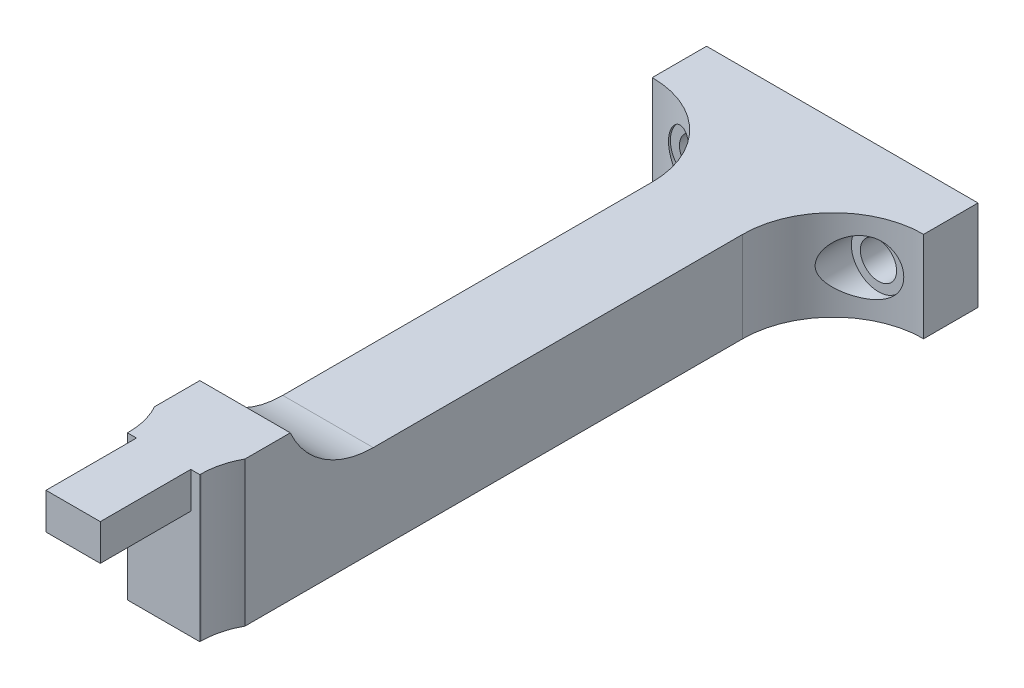
ISO-10303-21;
HEADER;
FILE_DESCRIPTION(('STEP AP214'),'2;1');
FILE_NAME('part.step','',(''),(''),'','','');
FILE_SCHEMA(('AUTOMOTIVE_DESIGN { 1 0 10303 214 1 1 1 1 }'));
ENDSEC;
DATA;
#1=APPLICATION_CONTEXT('core data for automotive mechanical design processes');
#2=APPLICATION_PROTOCOL_DEFINITION('international standard','automotive_design',2000,#1);
#3=PRODUCT_CONTEXT('',#1,'mechanical');
#4=PRODUCT('Part','Part','',(#3));
#5=PRODUCT_RELATED_PRODUCT_CATEGORY('part','',(#4));
#6=PRODUCT_DEFINITION_FORMATION('','',#4);
#7=PRODUCT_DEFINITION_CONTEXT('part definition',#1,'design');
#8=PRODUCT_DEFINITION('design','',#6,#7);
#9=PRODUCT_DEFINITION_SHAPE('','',#8);
#10=(LENGTH_UNIT() NAMED_UNIT(*) SI_UNIT(.MILLI.,.METRE.));
#11=(NAMED_UNIT(*) PLANE_ANGLE_UNIT() SI_UNIT($,.RADIAN.));
#12=(NAMED_UNIT(*) SI_UNIT($,.STERADIAN.) SOLID_ANGLE_UNIT());
#13=UNCERTAINTY_MEASURE_WITH_UNIT(LENGTH_MEASURE(1.E-05),#10,'distance_accuracy_value','');
#14=(GEOMETRIC_REPRESENTATION_CONTEXT(3) GLOBAL_UNCERTAINTY_ASSIGNED_CONTEXT((#13)) GLOBAL_UNIT_ASSIGNED_CONTEXT((#10,
#11,#12)) REPRESENTATION_CONTEXT('',''));
#15=CARTESIAN_POINT('',(0.,0.,0.));
#16=DIRECTION('',(0.,0.,1.));
#17=DIRECTION('',(1.,0.,0.));
#18=AXIS2_PLACEMENT_3D('',#15,#16,#17);
#19=CARTESIAN_POINT('',(0.,0.,69.));
#20=DIRECTION('',(0.,0.,-1.));
#21=DIRECTION('',(-1.,0.,0.));
#22=AXIS2_PLACEMENT_3D('',#19,#20,#21);
#23=PLANE('',#22);
#24=DIRECTION('',(0.,-1.,0.));
#25=VECTOR('',#24,1.);
#26=CARTESIAN_POINT('',(-3.,7.,69.));
#27=LINE('',#26,#25);
#28=CARTESIAN_POINT('',(-3.,11.,69.));
#29=VERTEX_POINT('',#28);
#30=CARTESIAN_POINT('',(-3.,7.,69.));
#31=VERTEX_POINT('',#30);
#32=EDGE_CURVE('E216',#29,#31,#27,.T.);
#33=ORIENTED_EDGE('',*,*,#32,.F.);
#34=DIRECTION('',(-1.,0.,0.));
#35=VECTOR('',#34,1.);
#36=CARTESIAN_POINT('',(-4.,11.,69.));
#37=LINE('',#36,#35);
#38=CARTESIAN_POINT('',(-4.,11.,69.));
#39=VERTEX_POINT('',#38);
#40=EDGE_CURVE('E229',#29,#39,#37,.T.);
#41=ORIENTED_EDGE('',*,*,#40,.T.);
#42=DIRECTION('',(0.,-1.,0.));
#43=VECTOR('',#42,1.);
#44=CARTESIAN_POINT('',(-4.,-5.,69.));
#45=LINE('',#44,#43);
#46=CARTESIAN_POINT('',(-4.,-5.,69.));
#47=VERTEX_POINT('',#46);
#48=EDGE_CURVE('E217',#39,#47,#45,.T.);
#49=ORIENTED_EDGE('',*,*,#48,.T.);
#50=DIRECTION('',(1.,0.,0.));
#51=VECTOR('',#50,1.);
#52=CARTESIAN_POINT('',(-4.,-5.,69.));
#53=LINE('',#52,#51);
#54=CARTESIAN_POINT('',(4.,-5.,69.));
#55=VERTEX_POINT('',#54);
#56=EDGE_CURVE('E220',#47,#55,#53,.T.);
#57=ORIENTED_EDGE('',*,*,#56,.T.);
#58=DIRECTION('',(0.,1.,0.));
#59=VECTOR('',#58,1.);
#60=CARTESIAN_POINT('',(4.,-5.,69.));
#61=LINE('',#60,#59);
#62=CARTESIAN_POINT('',(4.,11.,69.));
#63=VERTEX_POINT('',#62);
#64=EDGE_CURVE('E227',#55,#63,#61,.T.);
#65=ORIENTED_EDGE('',*,*,#64,.T.);
#66=CARTESIAN_POINT('',(3.,11.,69.));
#67=VERTEX_POINT('',#66);
#68=EDGE_CURVE('E230',#63,#67,#37,.T.);
#69=ORIENTED_EDGE('',*,*,#68,.T.);
#70=DIRECTION('',(0.,1.,0.));
#71=VECTOR('',#70,1.);
#72=CARTESIAN_POINT('',(3.,7.,69.));
#73=LINE('',#72,#71);
#74=CARTESIAN_POINT('',(3.,7.,69.));
#75=VERTEX_POINT('',#74);
#76=EDGE_CURVE('E213',#75,#67,#73,.T.);
#77=ORIENTED_EDGE('',*,*,#76,.F.);
#78=DIRECTION('',(1.,0.,0.));
#79=VECTOR('',#78,1.);
#80=CARTESIAN_POINT('',(-3.,7.,69.));
#81=LINE('',#80,#79);
#82=EDGE_CURVE('E476',#31,#75,#81,.T.);
#83=ORIENTED_EDGE('',*,*,#82,.F.);
#84=EDGE_LOOP('',(#33,#41,#49,#57,#65,#69,#77,#83));
#85=FACE_BOUND('',#84,.T.);
#86=ADVANCED_FACE('F67',(#85),#23,.F.);
#87=CARTESIAN_POINT('',(-5.,5.,65.));
#88=DIRECTION('',(0.,-1.,0.));
#89=DIRECTION('',(0.,0.,-1.));
#90=AXIS2_PLACEMENT_3D('',#87,#88,#89);
#91=PLANE('',#90);
#92=DIRECTION('',(0.,0.,-1.));
#93=VECTOR('',#92,1.);
#94=CARTESIAN_POINT('',(-5.,5.,65.));
#95=LINE('',#94,#93);
#96=CARTESIAN_POINT('',(-5.,5.,50.8348486100883));
#97=VERTEX_POINT('',#96);
#98=CARTESIAN_POINT('',(-5.,5.,10.));
#99=VERTEX_POINT('',#98);
#100=EDGE_CURVE('E295',#97,#99,#95,.T.);
#101=ORIENTED_EDGE('',*,*,#100,.F.);
#102=DIRECTION('',(1.,0.,0.));
#103=VECTOR('',#102,1.);
#104=CARTESIAN_POINT('',(-5.,5.,50.8348486100883));
#105=LINE('',#104,#103);
#106=CARTESIAN_POINT('',(5.,5.,50.8348486100883));
#107=VERTEX_POINT('',#106);
#108=EDGE_CURVE('E301',#97,#107,#105,.T.);
#109=ORIENTED_EDGE('',*,*,#108,.T.);
#110=DIRECTION('',(0.,0.,-1.));
#111=VECTOR('',#110,1.);
#112=CARTESIAN_POINT('',(5.,5.,65.));
#113=LINE('',#112,#111);
#114=CARTESIAN_POINT('',(5.,5.,10.));
#115=VERTEX_POINT('',#114);
#116=EDGE_CURVE('E298',#107,#115,#113,.T.);
#117=ORIENTED_EDGE('',*,*,#116,.T.);
#118=CARTESIAN_POINT('',(15.,5.,10.));
#119=DIRECTION('',(0.,-1.,0.));
#120=DIRECTION('',(0.,0.,-1.));
#121=AXIS2_PLACEMENT_3D('',#118,#119,#120);
#122=CIRCLE('',#121,10.);
#123=CARTESIAN_POINT('',(15.,5.,0.));
#124=VERTEX_POINT('',#123);
#125=EDGE_CURVE('E317',#115,#124,#122,.T.);
#126=ORIENTED_EDGE('',*,*,#125,.T.);
#127=DIRECTION('',(0.,0.,1.));
#128=VECTOR('',#127,1.);
#129=CARTESIAN_POINT('',(15.,5.,-6.));
#130=LINE('',#129,#128);
#131=CARTESIAN_POINT('',(15.,5.,-6.));
#132=VERTEX_POINT('',#131);
#133=EDGE_CURVE('E276',#132,#124,#130,.T.);
#134=ORIENTED_EDGE('',*,*,#133,.F.);
#135=DIRECTION('',(-1.,0.,0.));
#136=VECTOR('',#135,1.);
#137=CARTESIAN_POINT('',(15.,5.,-6.));
#138=LINE('',#137,#136);
#139=CARTESIAN_POINT('',(-15.,5.,-6.));
#140=VERTEX_POINT('',#139);
#141=EDGE_CURVE('E264',#132,#140,#138,.T.);
#142=ORIENTED_EDGE('',*,*,#141,.T.);
#143=DIRECTION('',(0.,0.,1.));
#144=VECTOR('',#143,1.);
#145=CARTESIAN_POINT('',(-15.,5.,-6.));
#146=LINE('',#145,#144);
#147=CARTESIAN_POINT('',(-15.,5.,0.));
#148=VERTEX_POINT('',#147);
#149=EDGE_CURVE('E279',#140,#148,#146,.T.);
#150=ORIENTED_EDGE('',*,*,#149,.T.);
#151=CARTESIAN_POINT('',(-15.,5.,10.));
#152=DIRECTION('',(0.,-1.,0.));
#153=DIRECTION('',(0.,0.,-1.));
#154=AXIS2_PLACEMENT_3D('',#151,#152,#153);
#155=CIRCLE('',#154,10.);
#156=EDGE_CURVE('E315',#148,#99,#155,.T.);
#157=ORIENTED_EDGE('',*,*,#156,.T.);
#158=EDGE_LOOP('',(#101,#109,#117,#126,#134,#142,#150,#157));
#159=FACE_BOUND('',#158,.T.);
#160=ADVANCED_FACE('F366',(#159),#91,.F.);
#161=CARTESIAN_POINT('',(5.,5.,65.));
#162=DIRECTION('',(-1.,0.,0.));
#163=DIRECTION('',(0.,-1.,0.));
#164=AXIS2_PLACEMENT_3D('',#161,#162,#163);
#165=PLANE('',#164);
#166=DIRECTION('',(0.,0.,-1.));
#167=VECTOR('',#166,1.);
#168=CARTESIAN_POINT('',(5.,-5.,65.));
#169=LINE('',#168,#167);
#170=CARTESIAN_POINT('',(5.,-5.,65.));
#171=VERTEX_POINT('',#170);
#172=CARTESIAN_POINT('',(5.,-5.,10.));
#173=VERTEX_POINT('',#172);
#174=EDGE_CURVE('E289',#171,#173,#169,.T.);
#175=ORIENTED_EDGE('',*,*,#174,.T.);
#176=DIRECTION('',(0.,1.,0.));
#177=VECTOR('',#176,1.);
#178=CARTESIAN_POINT('',(5.,5.,10.));
#179=LINE('',#178,#177);
#180=EDGE_CURVE('E306',#173,#115,#179,.T.);
#181=ORIENTED_EDGE('',*,*,#180,.T.);
#182=ORIENTED_EDGE('',*,*,#116,.F.);
#183=CARTESIAN_POINT('',(5.,15.,50.8348486100883));
#184=DIRECTION('',(-1.,0.,0.));
#185=DIRECTION('',(0.,-1.,0.));
#186=AXIS2_PLACEMENT_3D('',#183,#184,#185);
#187=CIRCLE('',#186,10.);
#188=CARTESIAN_POINT('',(5.,11.,60.));
#189=VERTEX_POINT('',#188);
#190=EDGE_CURVE('E311',#107,#189,#187,.T.);
#191=ORIENTED_EDGE('',*,*,#190,.T.);
#192=DIRECTION('',(0.,0.,-1.));
#193=VECTOR('',#192,1.);
#194=CARTESIAN_POINT('',(5.,11.,65.));
#195=LINE('',#194,#193);
#196=CARTESIAN_POINT('',(5.,11.,65.));
#197=VERTEX_POINT('',#196);
#198=EDGE_CURVE('E245',#197,#189,#195,.T.);
#199=ORIENTED_EDGE('',*,*,#198,.F.);
#200=DIRECTION('',(0.,1.,0.));
#201=VECTOR('',#200,1.);
#202=CARTESIAN_POINT('',(5.,5.,65.));
#203=LINE('',#202,#201);
#204=EDGE_CURVE('E284',#171,#197,#203,.T.);
#205=ORIENTED_EDGE('',*,*,#204,.F.);
#206=EDGE_LOOP('',(#175,#181,#182,#191,#199,#205));
#207=FACE_BOUND('',#206,.T.);
#208=ADVANCED_FACE('F405',(#207),#165,.F.);
#209=CARTESIAN_POINT('',(-5.,5.,65.));
#210=DIRECTION('',(1.,0.,0.));
#211=DIRECTION('',(0.,1.,0.));
#212=AXIS2_PLACEMENT_3D('',#209,#210,#211);
#213=PLANE('',#212);
#214=ORIENTED_EDGE('',*,*,#100,.T.);
#215=DIRECTION('',(0.,-1.,0.));
#216=VECTOR('',#215,1.);
#217=CARTESIAN_POINT('',(-5.,-5.,10.));
#218=LINE('',#217,#216);
#219=CARTESIAN_POINT('',(-5.,-5.,10.));
#220=VERTEX_POINT('',#219);
#221=EDGE_CURVE('E303',#99,#220,#218,.T.);
#222=ORIENTED_EDGE('',*,*,#221,.T.);
#223=DIRECTION('',(0.,0.,-1.));
#224=VECTOR('',#223,1.);
#225=CARTESIAN_POINT('',(-5.,-5.,65.));
#226=LINE('',#225,#224);
#227=CARTESIAN_POINT('',(-5.,-5.,65.));
#228=VERTEX_POINT('',#227);
#229=EDGE_CURVE('E292',#228,#220,#226,.T.);
#230=ORIENTED_EDGE('',*,*,#229,.F.);
#231=DIRECTION('',(0.,-1.,0.));
#232=VECTOR('',#231,1.);
#233=CARTESIAN_POINT('',(-5.,5.,65.));
#234=LINE('',#233,#232);
#235=CARTESIAN_POINT('',(-5.,11.,65.));
#236=VERTEX_POINT('',#235);
#237=EDGE_CURVE('E287',#236,#228,#234,.T.);
#238=ORIENTED_EDGE('',*,*,#237,.F.);
#239=DIRECTION('',(0.,0.,1.));
#240=VECTOR('',#239,1.);
#241=CARTESIAN_POINT('',(-5.,11.,65.));
#242=LINE('',#241,#240);
#243=CARTESIAN_POINT('',(-5.,11.,60.));
#244=VERTEX_POINT('',#243);
#245=EDGE_CURVE('E243',#244,#236,#242,.T.);
#246=ORIENTED_EDGE('',*,*,#245,.F.);
#247=CARTESIAN_POINT('',(-5.,15.,50.8348486100883));
#248=DIRECTION('',(1.,0.,0.));
#249=DIRECTION('',(0.,1.,0.));
#250=AXIS2_PLACEMENT_3D('',#247,#248,#249);
#251=CIRCLE('',#250,10.);
#252=EDGE_CURVE('E309',#244,#97,#251,.T.);
#253=ORIENTED_EDGE('',*,*,#252,.T.);
#254=EDGE_LOOP('',(#214,#222,#230,#238,#246,#253));
#255=FACE_BOUND('',#254,.T.);
#256=ADVANCED_FACE('F401',(#255),#213,.F.);
#257=CARTESIAN_POINT('',(-5.,-5.,65.));
#258=DIRECTION('',(0.,1.,0.));
#259=DIRECTION('',(0.,0.,1.));
#260=AXIS2_PLACEMENT_3D('',#257,#258,#259);
#261=PLANE('',#260);
#262=ORIENTED_EDGE('',*,*,#229,.T.);
#263=CARTESIAN_POINT('',(-15.,-5.,10.));
#264=DIRECTION('',(0.,1.,0.));
#265=DIRECTION('',(0.,0.,1.));
#266=AXIS2_PLACEMENT_3D('',#263,#264,#265);
#267=CIRCLE('',#266,10.);
#268=CARTESIAN_POINT('',(-15.,-5.,0.));
#269=VERTEX_POINT('',#268);
#270=EDGE_CURVE('E313',#220,#269,#267,.T.);
#271=ORIENTED_EDGE('',*,*,#270,.T.);
#272=DIRECTION('',(0.,0.,1.));
#273=VECTOR('',#272,1.);
#274=CARTESIAN_POINT('',(-15.,-5.,-6.));
#275=LINE('',#274,#273);
#276=CARTESIAN_POINT('',(-15.,-5.,-6.));
#277=VERTEX_POINT('',#276);
#278=EDGE_CURVE('E281',#277,#269,#275,.T.);
#279=ORIENTED_EDGE('',*,*,#278,.F.);
#280=DIRECTION('',(-1.,0.,0.));
#281=VECTOR('',#280,1.);
#282=CARTESIAN_POINT('',(15.,-5.,-6.));
#283=LINE('',#282,#281);
#284=CARTESIAN_POINT('',(15.,-5.,-6.));
#285=VERTEX_POINT('',#284);
#286=EDGE_CURVE('E258',#285,#277,#283,.T.);
#287=ORIENTED_EDGE('',*,*,#286,.F.);
#288=DIRECTION('',(0.,0.,1.));
#289=VECTOR('',#288,1.);
#290=CARTESIAN_POINT('',(15.,-5.,-6.));
#291=LINE('',#290,#289);
#292=CARTESIAN_POINT('',(15.,-5.,0.));
#293=VERTEX_POINT('',#292);
#294=EDGE_CURVE('E270',#285,#293,#291,.T.);
#295=ORIENTED_EDGE('',*,*,#294,.T.);
#296=CARTESIAN_POINT('',(15.,-5.,10.));
#297=DIRECTION('',(0.,1.,0.));
#298=DIRECTION('',(0.,0.,1.));
#299=AXIS2_PLACEMENT_3D('',#296,#297,#298);
#300=CIRCLE('',#299,10.);
#301=EDGE_CURVE('E319',#293,#173,#300,.T.);
#302=ORIENTED_EDGE('',*,*,#301,.T.);
#303=ORIENTED_EDGE('',*,*,#174,.F.);
#304=CARTESIAN_POINT('',(12.,-5.,68.8729833462074));
#305=DIRECTION('',(0.,1.,0.));
#306=DIRECTION('',(0.,0.,1.));
#307=AXIS2_PLACEMENT_3D('',#304,#305,#306);
#308=CIRCLE('',#307,8.);
#309=CARTESIAN_POINT('',(4.,-5.,68.8729833462074));
#310=VERTEX_POINT('',#309);
#311=EDGE_CURVE('E445',#171,#310,#308,.T.);
#312=ORIENTED_EDGE('',*,*,#311,.T.);
#313=DIRECTION('',(0.,0.,-1.));
#314=VECTOR('',#313,1.);
#315=CARTESIAN_POINT('',(4.,-5.,69.));
#316=LINE('',#315,#314);
#317=EDGE_CURVE('E237',#55,#310,#316,.T.);
#318=ORIENTED_EDGE('',*,*,#317,.F.);
#319=ORIENTED_EDGE('',*,*,#56,.F.);
#320=DIRECTION('',(0.,0.,-1.));
#321=VECTOR('',#320,1.);
#322=CARTESIAN_POINT('',(-4.,-5.,69.));
#323=LINE('',#322,#321);
#324=CARTESIAN_POINT('',(-4.,-5.,68.8729833462074));
#325=VERTEX_POINT('',#324);
#326=EDGE_CURVE('E240',#47,#325,#323,.T.);
#327=ORIENTED_EDGE('',*,*,#326,.T.);
#328=CARTESIAN_POINT('',(-12.,-5.,68.8729833462074));
#329=DIRECTION('',(0.,1.,0.));
#330=DIRECTION('',(0.,0.,1.));
#331=AXIS2_PLACEMENT_3D('',#328,#329,#330);
#332=CIRCLE('',#331,8.);
#333=EDGE_CURVE('E75',#325,#228,#332,.T.);
#334=ORIENTED_EDGE('',*,*,#333,.T.);
#335=EDGE_LOOP('',(#262,#271,#279,#287,#295,#302,#303,#312,#318,#319,#327,#334));
#336=FACE_BOUND('',#335,.T.);
#337=ADVANCED_FACE('F391',(#336),#261,.F.);
#338=CARTESIAN_POINT('',(0.,0.,-6.));
#339=DIRECTION('',(0.,0.,-1.));
#340=DIRECTION('',(-1.,0.,0.));
#341=AXIS2_PLACEMENT_3D('',#338,#339,#340);
#342=PLANE('',#341);
#343=CARTESIAN_POINT('',(10.,0.,-6.));
#344=DIRECTION('',(0.,0.,-1.));
#345=DIRECTION('',(-1.,0.,0.));
#346=AXIS2_PLACEMENT_3D('',#343,#344,#345);
#347=CIRCLE('',#346,2.);
#348=CARTESIAN_POINT('',(8.00000000000001,0.,-6.));
#349=VERTEX_POINT('',#348);
#350=EDGE_CURVE('E254',#349,#349,#347,.T.);
#351=ORIENTED_EDGE('',*,*,#350,.F.);
#352=EDGE_LOOP('',(#351));
#353=FACE_BOUND('',#352,.T.);
#354=ORIENTED_EDGE('',*,*,#286,.T.);
#355=DIRECTION('',(0.,1.,0.));
#356=VECTOR('',#355,1.);
#357=CARTESIAN_POINT('',(-15.,-5.,-6.));
#358=LINE('',#357,#356);
#359=EDGE_CURVE('E261',#277,#140,#358,.T.);
#360=ORIENTED_EDGE('',*,*,#359,.T.);
#361=ORIENTED_EDGE('',*,*,#141,.F.);
#362=DIRECTION('',(0.,1.,0.));
#363=VECTOR('',#362,1.);
#364=CARTESIAN_POINT('',(15.,-5.,-6.));
#365=LINE('',#364,#363);
#366=EDGE_CURVE('E267',#285,#132,#365,.T.);
#367=ORIENTED_EDGE('',*,*,#366,.F.);
#368=EDGE_LOOP('',(#354,#360,#361,#367));
#369=FACE_BOUND('',#368,.T.);
#370=CARTESIAN_POINT('',(-10.,0.,-6.));
#371=DIRECTION('',(0.,0.,-1.));
#372=DIRECTION('',(-1.,0.,0.));
#373=AXIS2_PLACEMENT_3D('',#370,#371,#372);
#374=CIRCLE('',#373,2.);
#375=CARTESIAN_POINT('',(-12.,0.,-6.));
#376=VERTEX_POINT('',#375);
#377=EDGE_CURVE('E251',#376,#376,#374,.T.);
#378=ORIENTED_EDGE('',*,*,#377,.F.);
#379=EDGE_LOOP('',(#378));
#380=FACE_BOUND('',#379,.T.);
#381=ADVANCED_FACE('F387',(#353,#369,#380),#342,.T.);
#382=CARTESIAN_POINT('',(-15.,-5.,-6.));
#383=DIRECTION('',(1.,0.,0.));
#384=DIRECTION('',(0.,0.,-1.));
#385=AXIS2_PLACEMENT_3D('',#382,#383,#384);
#386=PLANE('',#385);
#387=DIRECTION('',(0.,1.,0.));
#388=VECTOR('',#387,1.);
#389=CARTESIAN_POINT('',(-15.,-5.,0.));
#390=LINE('',#389,#388);
#391=EDGE_CURVE('E257',#269,#148,#390,.T.);
#392=ORIENTED_EDGE('',*,*,#391,.T.);
#393=ORIENTED_EDGE('',*,*,#149,.F.);
#394=ORIENTED_EDGE('',*,*,#359,.F.);
#395=ORIENTED_EDGE('',*,*,#278,.T.);
#396=EDGE_LOOP('',(#392,#393,#394,#395));
#397=FACE_BOUND('',#396,.T.);
#398=ADVANCED_FACE('F390',(#397),#386,.F.);
#399=CARTESIAN_POINT('',(15.,-5.,-6.));
#400=DIRECTION('',(1.,0.,0.));
#401=DIRECTION('',(0.,0.,-1.));
#402=AXIS2_PLACEMENT_3D('',#399,#400,#401);
#403=PLANE('',#402);
#404=DIRECTION('',(0.,1.,0.));
#405=VECTOR('',#404,1.);
#406=CARTESIAN_POINT('',(15.,-5.,0.));
#407=LINE('',#406,#405);
#408=EDGE_CURVE('E262',#293,#124,#407,.T.);
#409=ORIENTED_EDGE('',*,*,#408,.F.);
#410=ORIENTED_EDGE('',*,*,#294,.F.);
#411=ORIENTED_EDGE('',*,*,#366,.T.);
#412=ORIENTED_EDGE('',*,*,#133,.T.);
#413=EDGE_LOOP('',(#409,#410,#411,#412));
#414=FACE_BOUND('',#413,.T.);
#415=ADVANCED_FACE('F385',(#414),#403,.T.);
#416=CARTESIAN_POINT('',(10.,0.,-6.));
#417=DIRECTION('',(0.,0.,1.));
#418=DIRECTION('',(1.,0.,0.));
#419=AXIS2_PLACEMENT_3D('',#416,#417,#418);
#420=CYLINDRICAL_SURFACE('',#419,2.);
#421=CARTESIAN_POINT('',(10.,0.,0.));
#422=DIRECTION('',(0.,0.,-1.));
#423=DIRECTION('',(-1.,0.,0.));
#424=AXIS2_PLACEMENT_3D('',#421,#422,#423);
#425=CIRCLE('',#424,2.);
#426=CARTESIAN_POINT('',(8.00000000000001,0.,0.));
#427=VERTEX_POINT('',#426);
#428=EDGE_CURVE('E453',#427,#427,#425,.T.);
#429=ORIENTED_EDGE('',*,*,#428,.F.);
#430=EDGE_LOOP('',(#429));
#431=FACE_BOUND('',#430,.T.);
#432=ORIENTED_EDGE('',*,*,#350,.T.);
#433=EDGE_LOOP('',(#432));
#434=FACE_BOUND('',#433,.T.);
#435=ADVANCED_FACE('F381',(#431,#434),#420,.F.);
#436=CARTESIAN_POINT('',(-10.,0.,-6.));
#437=DIRECTION('',(0.,0.,1.));
#438=DIRECTION('',(1.,0.,0.));
#439=AXIS2_PLACEMENT_3D('',#436,#437,#438);
#440=CYLINDRICAL_SURFACE('',#439,2.);
#441=CARTESIAN_POINT('',(-10.,0.,0.));
#442=DIRECTION('',(0.,0.,-1.));
#443=DIRECTION('',(-1.,0.,0.));
#444=AXIS2_PLACEMENT_3D('',#441,#442,#443);
#445=CIRCLE('',#444,2.);
#446=CARTESIAN_POINT('',(-12.,0.,0.));
#447=VERTEX_POINT('',#446);
#448=EDGE_CURVE('E455',#447,#447,#445,.T.);
#449=ORIENTED_EDGE('',*,*,#448,.F.);
#450=EDGE_LOOP('',(#449));
#451=FACE_BOUND('',#450,.T.);
#452=ORIENTED_EDGE('',*,*,#377,.T.);
#453=EDGE_LOOP('',(#452));
#454=FACE_BOUND('',#453,.T.);
#455=ADVANCED_FACE('F378',(#451,#454),#440,.F.);
#456=CARTESIAN_POINT('',(0.,11.,0.));
#457=DIRECTION('',(0.,-1.,0.));
#458=DIRECTION('',(0.,0.,-1.));
#459=AXIS2_PLACEMENT_3D('',#456,#457,#458);
#460=PLANE('',#459);
#461=ORIENTED_EDGE('',*,*,#245,.T.);
#462=CARTESIAN_POINT('',(-12.,11.,68.8729833462074));
#463=DIRECTION('',(0.,-1.,0.));
#464=DIRECTION('',(0.,0.,-1.));
#465=AXIS2_PLACEMENT_3D('',#462,#463,#464);
#466=CIRCLE('',#465,8.);
#467=CARTESIAN_POINT('',(-4.,11.,68.8729833462074));
#468=VERTEX_POINT('',#467);
#469=EDGE_CURVE('E13',#236,#468,#466,.T.);
#470=ORIENTED_EDGE('',*,*,#469,.T.);
#471=DIRECTION('',(0.,0.,-1.));
#472=VECTOR('',#471,1.);
#473=CARTESIAN_POINT('',(-4.,11.,69.));
#474=LINE('',#473,#472);
#475=EDGE_CURVE('E232',#39,#468,#474,.T.);
#476=ORIENTED_EDGE('',*,*,#475,.F.);
#477=ORIENTED_EDGE('',*,*,#40,.F.);
#478=DIRECTION('',(0.,0.,-1.));
#479=VECTOR('',#478,1.);
#480=CARTESIAN_POINT('',(-3.,11.,79.));
#481=LINE('',#480,#479);
#482=CARTESIAN_POINT('',(-3.,11.,79.));
#483=VERTEX_POINT('',#482);
#484=EDGE_CURVE('E474',#483,#29,#481,.T.);
#485=ORIENTED_EDGE('',*,*,#484,.F.);
#486=DIRECTION('',(-1.,0.,0.));
#487=VECTOR('',#486,1.);
#488=CARTESIAN_POINT('',(-3.,11.,79.));
#489=LINE('',#488,#487);
#490=CARTESIAN_POINT('',(3.,11.,79.));
#491=VERTEX_POINT('',#490);
#492=EDGE_CURVE('E209',#491,#483,#489,.T.);
#493=ORIENTED_EDGE('',*,*,#492,.F.);
#494=DIRECTION('',(0.,0.,-1.));
#495=VECTOR('',#494,1.);
#496=CARTESIAN_POINT('',(3.,11.,79.));
#497=LINE('',#496,#495);
#498=EDGE_CURVE('E222',#491,#67,#497,.T.);
#499=ORIENTED_EDGE('',*,*,#498,.T.);
#500=ORIENTED_EDGE('',*,*,#68,.F.);
#501=DIRECTION('',(0.,0.,-1.));
#502=VECTOR('',#501,1.);
#503=CARTESIAN_POINT('',(4.,11.,69.));
#504=LINE('',#503,#502);
#505=CARTESIAN_POINT('',(4.,11.,68.8729833462074));
#506=VERTEX_POINT('',#505);
#507=EDGE_CURVE('E234',#63,#506,#504,.T.);
#508=ORIENTED_EDGE('',*,*,#507,.T.);
#509=CARTESIAN_POINT('',(12.,11.,68.8729833462074));
#510=DIRECTION('',(0.,-1.,0.));
#511=DIRECTION('',(0.,0.,-1.));
#512=AXIS2_PLACEMENT_3D('',#509,#510,#511);
#513=CIRCLE('',#512,8.);
#514=EDGE_CURVE('E437',#506,#197,#513,.T.);
#515=ORIENTED_EDGE('',*,*,#514,.T.);
#516=ORIENTED_EDGE('',*,*,#198,.T.);
#517=DIRECTION('',(-1.,0.,0.));
#518=VECTOR('',#517,1.);
#519=CARTESIAN_POINT('',(-5.,11.,60.));
#520=LINE('',#519,#518);
#521=EDGE_CURVE('E248',#189,#244,#520,.T.);
#522=ORIENTED_EDGE('',*,*,#521,.T.);
#523=EDGE_LOOP('',(#461,#470,#476,#477,#485,#493,#499,#500,#508,#515,#516,#522));
#524=FACE_BOUND('',#523,.T.);
#525=ADVANCED_FACE('F374',(#524),#460,.F.);
#526=CARTESIAN_POINT('',(-4.,-5.,69.));
#527=DIRECTION('',(1.,0.,0.));
#528=DIRECTION('',(0.,0.,-1.));
#529=AXIS2_PLACEMENT_3D('',#526,#527,#528);
#530=PLANE('',#529);
#531=ORIENTED_EDGE('',*,*,#475,.T.);
#532=DIRECTION('',(0.,1.,0.));
#533=VECTOR('',#532,1.);
#534=CARTESIAN_POINT('',(-4.,-5.,68.8729833462074));
#535=LINE('',#534,#533);
#536=EDGE_CURVE('E448',#468,#325,#535,.F.);
#537=ORIENTED_EDGE('',*,*,#536,.T.);
#538=ORIENTED_EDGE('',*,*,#326,.F.);
#539=ORIENTED_EDGE('',*,*,#48,.F.);
#540=EDGE_LOOP('',(#531,#537,#538,#539));
#541=FACE_BOUND('',#540,.T.);
#542=ADVANCED_FACE('F370',(#541),#530,.F.);
#543=CARTESIAN_POINT('',(4.,-5.,69.));
#544=DIRECTION('',(-1.,0.,0.));
#545=DIRECTION('',(0.,0.,1.));
#546=AXIS2_PLACEMENT_3D('',#543,#544,#545);
#547=PLANE('',#546);
#548=ORIENTED_EDGE('',*,*,#317,.T.);
#549=DIRECTION('',(0.,-1.,0.));
#550=VECTOR('',#549,1.);
#551=CARTESIAN_POINT('',(4.,-5.,68.8729833462074));
#552=LINE('',#551,#550);
#553=EDGE_CURVE('E321',#310,#506,#552,.F.);
#554=ORIENTED_EDGE('',*,*,#553,.T.);
#555=ORIENTED_EDGE('',*,*,#507,.F.);
#556=ORIENTED_EDGE('',*,*,#64,.F.);
#557=EDGE_LOOP('',(#548,#554,#555,#556));
#558=FACE_BOUND('',#557,.T.);
#559=ADVANCED_FACE('F363',(#558),#547,.F.);
#560=CARTESIAN_POINT('',(-3.,7.,79.));
#561=DIRECTION('',(1.,0.,0.));
#562=DIRECTION('',(0.,0.,-1.));
#563=AXIS2_PLACEMENT_3D('',#560,#561,#562);
#564=PLANE('',#563);
#565=ORIENTED_EDGE('',*,*,#32,.T.);
#566=DIRECTION('',(0.,0.,-1.));
#567=VECTOR('',#566,1.);
#568=CARTESIAN_POINT('',(-3.,7.,79.));
#569=LINE('',#568,#567);
#570=CARTESIAN_POINT('',(-3.,7.,79.));
#571=VERTEX_POINT('',#570);
#572=EDGE_CURVE('E197',#571,#31,#569,.T.);
#573=ORIENTED_EDGE('',*,*,#572,.F.);
#574=DIRECTION('',(0.,-1.,0.));
#575=VECTOR('',#574,1.);
#576=CARTESIAN_POINT('',(-3.,7.,79.));
#577=LINE('',#576,#575);
#578=EDGE_CURVE('E204',#483,#571,#577,.T.);
#579=ORIENTED_EDGE('',*,*,#578,.F.);
#580=ORIENTED_EDGE('',*,*,#484,.T.);
#581=EDGE_LOOP('',(#565,#573,#579,#580));
#582=FACE_BOUND('',#581,.T.);
#583=ADVANCED_FACE('F215',(#582),#564,.F.);
#584=CARTESIAN_POINT('',(-3.,7.,79.));
#585=DIRECTION('',(0.,1.,0.));
#586=DIRECTION('',(0.,0.,1.));
#587=AXIS2_PLACEMENT_3D('',#584,#585,#586);
#588=PLANE('',#587);
#589=ORIENTED_EDGE('',*,*,#82,.T.);
#590=DIRECTION('',(0.,0.,-1.));
#591=VECTOR('',#590,1.);
#592=CARTESIAN_POINT('',(3.,7.,79.));
#593=LINE('',#592,#591);
#594=CARTESIAN_POINT('',(3.,7.,79.));
#595=VERTEX_POINT('',#594);
#596=EDGE_CURVE('E200',#595,#75,#593,.T.);
#597=ORIENTED_EDGE('',*,*,#596,.F.);
#598=DIRECTION('',(1.,0.,0.));
#599=VECTOR('',#598,1.);
#600=CARTESIAN_POINT('',(-3.,7.,79.));
#601=LINE('',#600,#599);
#602=EDGE_CURVE('E192',#571,#595,#601,.T.);
#603=ORIENTED_EDGE('',*,*,#602,.F.);
#604=ORIENTED_EDGE('',*,*,#572,.T.);
#605=EDGE_LOOP('',(#589,#597,#603,#604));
#606=FACE_BOUND('',#605,.T.);
#607=ADVANCED_FACE('F195',(#606),#588,.F.);
#608=CARTESIAN_POINT('',(3.,7.,79.));
#609=DIRECTION('',(-1.,0.,0.));
#610=DIRECTION('',(0.,0.,1.));
#611=AXIS2_PLACEMENT_3D('',#608,#609,#610);
#612=PLANE('',#611);
#613=ORIENTED_EDGE('',*,*,#76,.T.);
#614=ORIENTED_EDGE('',*,*,#498,.F.);
#615=DIRECTION('',(0.,1.,0.));
#616=VECTOR('',#615,1.);
#617=CARTESIAN_POINT('',(3.,7.,79.));
#618=LINE('',#617,#616);
#619=EDGE_CURVE('E203',#595,#491,#618,.T.);
#620=ORIENTED_EDGE('',*,*,#619,.F.);
#621=ORIENTED_EDGE('',*,*,#596,.T.);
#622=EDGE_LOOP('',(#613,#614,#620,#621));
#623=FACE_BOUND('',#622,.T.);
#624=ADVANCED_FACE('F355',(#623),#612,.F.);
#625=CARTESIAN_POINT('',(0.,0.,79.));
#626=DIRECTION('',(0.,0.,-1.));
#627=DIRECTION('',(-1.,0.,0.));
#628=AXIS2_PLACEMENT_3D('',#625,#626,#627);
#629=PLANE('',#628);
#630=ORIENTED_EDGE('',*,*,#578,.T.);
#631=ORIENTED_EDGE('',*,*,#602,.T.);
#632=ORIENTED_EDGE('',*,*,#619,.T.);
#633=ORIENTED_EDGE('',*,*,#492,.T.);
#634=EDGE_LOOP('',(#630,#631,#632,#633));
#635=FACE_BOUND('',#634,.T.);
#636=ADVANCED_FACE('F207',(#635),#629,.F.);
#637=CARTESIAN_POINT('',(-5.,15.,50.8348486100883));
#638=DIRECTION('',(1.,0.,0.));
#639=DIRECTION('',(0.,0.,-1.));
#640=AXIS2_PLACEMENT_3D('',#637,#638,#639);
#641=CYLINDRICAL_SURFACE('',#640,10.);
#642=ORIENTED_EDGE('',*,*,#190,.F.);
#643=ORIENTED_EDGE('',*,*,#108,.F.);
#644=ORIENTED_EDGE('',*,*,#252,.F.);
#645=ORIENTED_EDGE('',*,*,#521,.F.);
#646=EDGE_LOOP('',(#642,#643,#644,#645));
#647=FACE_BOUND('',#646,.T.);
#648=ADVANCED_FACE('F354',(#647),#641,.F.);
#649=CARTESIAN_POINT('',(-15.,5.,10.));
#650=DIRECTION('',(0.,1.,0.));
#651=DIRECTION('',(-1.,0.,0.));
#652=AXIS2_PLACEMENT_3D('',#649,#650,#651);
#653=CYLINDRICAL_SURFACE('',#652,10.);
#654=CARTESIAN_POINT('',(-7.00000000000001,0.,3.99999999999999));
#655=CARTESIAN_POINT('',(-6.99999936545019,-0.0639580474947524,4.0000010063539));
#656=CARTESIAN_POINT('',(-7.00205081441998,-0.127911962576395,3.99726270727629));
#657=CARTESIAN_POINT('',(-7.01018872197734,-0.255134551244694,3.98643522540965));
#658=CARTESIAN_POINT('',(-7.01627730588466,-0.318402846051847,3.9783432242088));
#659=CARTESIAN_POINT('',(-7.03232131801765,-0.443713732244706,3.95713050528279));
#660=CARTESIAN_POINT('',(-7.04228445192824,-0.505753620554789,3.94399976723784));
#661=CARTESIAN_POINT('',(-7.06580873666659,-0.628016256241741,3.9132123361496));
#662=CARTESIAN_POINT('',(-7.07937208121888,-0.688237870683225,3.89555288383752));
#663=CARTESIAN_POINT('',(-7.12456405752893,-0.863901144119311,3.83721679340689));
#664=CARTESIAN_POINT('',(-7.16095639549193,-0.976259632054699,3.79082636235552));
#665=CARTESIAN_POINT('',(-7.24428415196152,-1.19138118633643,3.68705410449046));
#666=CARTESIAN_POINT('',(-7.29122472128043,-1.29413953000764,3.62966690986431));
#667=CARTESIAN_POINT('',(-7.38532623927266,-1.47375486068753,3.51762585423823));
#668=CARTESIAN_POINT('',(-7.43112977561075,-1.55206542466172,3.46412787280524));
#669=CARTESIAN_POINT('',(-7.52820877283545,-1.7024287200607,3.35336466069895));
#670=CARTESIAN_POINT('',(-7.57948733673994,-1.77447786036318,3.29609730082564));
#671=CARTESIAN_POINT('',(-7.68708682577442,-1.91261853916225,3.17888280618118));
#672=CARTESIAN_POINT('',(-7.74341602216886,-1.97869993575601,3.11893135920328));
#673=CARTESIAN_POINT('',(-7.86066388853778,-2.10491201575344,2.99735570878201));
#674=CARTESIAN_POINT('',(-7.92158181692342,-2.1650436570835,2.93573177665575));
#675=CARTESIAN_POINT('',(-8.11604003194662,-2.34140675753415,2.74431493095229));
#676=CARTESIAN_POINT('',(-8.25687487887006,-2.44798474325325,2.61286898325364));
#677=CARTESIAN_POINT('',(-8.55559590127228,-2.63528757477433,2.35087240351365));
#678=CARTESIAN_POINT('',(-8.71348505787067,-2.71600789080455,2.22032193225836));
#679=CARTESIAN_POINT('',(-8.97695068348841,-2.82215071932402,2.01637239825021));
#680=CARTESIAN_POINT('',(-9.07765892114912,-2.85670747211661,1.94134169245177));
#681=CARTESIAN_POINT('',(-9.28392151361941,-2.91525764637161,1.7937516058007));
#682=CARTESIAN_POINT('',(-9.38947686184347,-2.93924889166867,1.72119273690627));
#683=CARTESIAN_POINT('',(-9.60457174144048,-2.97582184530266,1.57943500241186));
#684=CARTESIAN_POINT('',(-9.71410603857911,-2.98841801592189,1.51023198359734));
#685=CARTESIAN_POINT('',(-9.93626691974788,-3.00138673276396,1.37587833344838));
#686=CARTESIAN_POINT('',(-10.048892059233,-3.00176489504116,1.31072585401375));
#687=CARTESIAN_POINT('',(-10.3248583417205,-2.98677930261326,1.1582065672249));
#688=CARTESIAN_POINT('',(-10.489260872524,-2.96460383695964,1.07327715405638));
#689=CARTESIAN_POINT('',(-10.8171631624548,-2.89144058565202,0.915011740924842));
#690=CARTESIAN_POINT('',(-10.9806635181588,-2.84047495055119,0.841666883494357));
#691=CARTESIAN_POINT('',(-11.3016919764148,-2.7084757489328,0.707372058693041));
#692=CARTESIAN_POINT('',(-11.459186295491,-2.62729375949849,0.646485614028085));
#693=CARTESIAN_POINT('',(-11.7604246120561,-2.43571973218208,0.537927131293979));
#694=CARTESIAN_POINT('',(-11.9041713222746,-2.32533347325382,0.490252482685982));
#695=CARTESIAN_POINT('',(-12.1594959629055,-2.0890582440682,0.411054141464016));
#696=CARTESIAN_POINT('',(-12.2727866459124,-1.96536371744377,0.378483864203331));
#697=CARTESIAN_POINT('',(-12.4779009195916,-1.69946474540398,0.322689254449985));
#698=CARTESIAN_POINT('',(-12.569728929336,-1.55726411971811,0.299462997352268));
#699=CARTESIAN_POINT('',(-12.7258787764663,-1.26347480993851,0.26169192059101));
#700=CARTESIAN_POINT('',(-12.7909982732767,-1.11234204479826,0.24688925312525));
#701=CARTESIAN_POINT('',(-12.8957447302682,-0.801019920900513,0.223752997076648));
#702=CARTESIAN_POINT('',(-12.9353722064788,-0.640830745541391,0.215419277543573));
#703=CARTESIAN_POINT('',(-12.9878760129992,-0.315793819119311,0.204486367746636));
#704=CARTESIAN_POINT('',(-13.0007285629571,-0.150942058521785,0.201892275048607));
#705=CARTESIAN_POINT('',(-12.9992075291032,0.178634858930424,0.202202827228877));
#706=CARTESIAN_POINT('',(-12.9848332253238,0.343360012321966,0.205107617515729));
#707=CARTESIAN_POINT('',(-12.929233702839,0.668476220704544,0.216711903043684));
#708=CARTESIAN_POINT('',(-12.8879347490818,0.828854110458694,0.225427312563521));
#709=CARTESIAN_POINT('',(-12.7797603549211,1.14021475792805,0.249431604005334));
#710=CARTESIAN_POINT('',(-12.7128859799662,1.291197906715,0.264720212097144));
#711=CARTESIAN_POINT('',(-12.5560329921467,1.57907961667414,0.302913166464331));
#712=CARTESIAN_POINT('',(-12.4661143304782,1.71601345269859,0.325797796127237));
#713=CARTESIAN_POINT('',(-12.2662842952773,1.97240128101307,0.380359252454907));
#714=CARTESIAN_POINT('',(-12.1563750324969,2.09185711635593,0.412035151059607));
#715=CARTESIAN_POINT('',(-11.920790229725,2.31004287077673,0.485084729878436));
#716=CARTESIAN_POINT('',(-11.7951421067772,2.40880805217818,0.526441652057905));
#717=CARTESIAN_POINT('',(-11.5325232842208,2.58385086374915,0.619382393943519));
#718=CARTESIAN_POINT('',(-11.3955522045112,2.66012773861448,0.670966557049911));
#719=CARTESIAN_POINT('',(-11.1114698108555,2.79100573462286,0.785697866358669));
#720=CARTESIAN_POINT('',(-10.9641897044746,2.84501028418465,0.849104309914691));
#721=CARTESIAN_POINT('',(-10.6674145235243,2.92888507960492,0.985820622061658));
#722=CARTESIAN_POINT('',(-10.5179187044395,2.95874701693132,1.05913388990345));
#723=CARTESIAN_POINT('',(-10.2078062938377,2.99721572511678,1.22115871169223));
#724=CARTESIAN_POINT('',(-10.0473477188375,3.00375798574501,1.31065392580269));
#725=CARTESIAN_POINT('',(-9.73233644301305,2.99219573064764,1.49791959998534));
#726=CARTESIAN_POINT('',(-9.57778588362378,2.97408236365052,1.59569302008126));
#727=CARTESIAN_POINT('',(-9.25424124403232,2.91118651062229,1.81282903920736));
#728=CARTESIAN_POINT('',(-9.08664637454241,2.86275333625991,1.93320823299305));
#729=CARTESIAN_POINT('',(-8.76514839583082,2.73949749872395,2.1790257250266));
#730=CARTESIAN_POINT('',(-8.61126416211108,2.66463913802351,2.30447066251359));
#731=CARTESIAN_POINT('',(-8.37975697045508,2.52679768277886,2.50432181877446));
#732=CARTESIAN_POINT('',(-8.29695444581863,2.47174574468156,2.5783392795079));
#733=CARTESIAN_POINT('',(-8.13696104414039,2.35350463937467,2.72603718631645));
#734=CARTESIAN_POINT('',(-8.05977171801285,2.29031323651361,2.79971753401819));
#735=CARTESIAN_POINT('',(-7.9114394305461,2.15590542551582,2.94570132982635));
#736=CARTESIAN_POINT('',(-7.84029231630973,2.08469460883196,3.01800569670417));
#737=CARTESIAN_POINT('',(-7.70446505045932,1.93411281226429,3.16005665263915));
#738=CARTESIAN_POINT('',(-7.63978156148211,1.85474608691048,3.22980454977453));
#739=CARTESIAN_POINT('',(-7.50144921957988,1.66563827545644,3.38298028906279));
#740=CARTESIAN_POINT('',(-7.42987449403761,1.55337949655743,3.46522016589579));
#741=CARTESIAN_POINT('',(-7.29996901962333,1.31462516992807,3.61880828881777));
#742=CARTESIAN_POINT('',(-7.24161676929314,1.18815324306599,3.69017415463245));
#743=CARTESIAN_POINT('',(-7.15327564190431,0.952860684280505,3.8005905177712));
#744=CARTESIAN_POINT('',(-7.11984078643101,0.84707234421284,3.84328674952101));
#745=CARTESIAN_POINT('',(-7.06434887200488,0.628173567213787,3.9149755027086));
#746=CARTESIAN_POINT('',(-7.0422627624288,0.515082668216829,3.94400299740271));
#747=CARTESIAN_POINT('',(-7.01792503452369,0.334108365865147,3.9761572757587));
#748=CARTESIAN_POINT('',(-7.01122670502552,0.26780143331493,3.98505594930985));
#749=CARTESIAN_POINT('',(-7.00226415182383,0.134328242376529,3.99697727218582));
#750=CARTESIAN_POINT('',(-7.00000066633577,0.0671618427957333,3.99999894323567));
#751=CARTESIAN_POINT('',(-7.00000000000001,0.,3.99999999999999));
#752=B_SPLINE_CURVE_WITH_KNOTS('',3,(#654,#655,#656,#657,#658,#659,#660,#661,#662,#663,#664,
#665,#666,#667,#668,#669,#670,#671,#672,#673,#674,#675,#676,#677,#678,#679,#680,#681,#682,#683,
#684,#685,#686,#687,#688,#689,#690,#691,#692,#693,#694,#695,#696,#697,#698,#699,#700,#701,#702,
#703,#704,#705,#706,#707,#708,#709,#710,#711,#712,#713,#714,#715,#716,#717,#718,#719,#720,#721,
#722,#723,#724,#725,#726,#727,#728,#729,#730,#731,#732,#733,#734,#735,#736,#737,#738,#739,#740,
#741,#742,#743,#744,#745,#746,#747,#748,#749,#750,#751),.UNSPECIFIED.,.T.,.F.,(4,2,2,2,2,2,2,2,
2,2,2,2,2,2,2,2,2,2,2,2,2,2,2,2,2,2,2,2,2,2,2,2,2,2,2,2,2,2,2,2,2,2,2,2,2,2,2,2,4),(0.,
0.191777463993348,0.383655968051955,0.575918046883636,0.768297547211918,1.14723549330172,
1.5263588824301,1.84189540775,2.15761172499001,2.47385486926565,2.79004701442171,
3.4481706877573,4.10640958887016,4.49669936276742,4.8870694866432,5.27694346669653,
5.66663823712983,6.22324115710853,6.779416420581,7.33836046952565,7.89719399699233,
8.40724503359312,8.91719096018878,9.41054701666633,9.90389308592853,10.3976771377229,
10.891474246974,11.3866293672844,11.8817638621305,12.3756230823342,12.8694301875585,
13.3623887431617,13.855363853647,14.3607987031336,14.8664074209728,15.4157992025132,
15.9653882655273,16.598916960181,17.2333047785141,17.60483974293,17.9764769746375,
18.3478566719764,18.719043613154,19.1872267496352,19.654643007086,20.0100552141871,
20.3645530439211,20.5659035374217,20.7672875444857),.UNSPECIFIED.);
#753=CARTESIAN_POINT('',(-7.00000000000001,0.,3.99999999999999));
#754=VERTEX_POINT('',#753);
#755=EDGE_CURVE('E330',#754,#754,#752,.T.);
#756=ORIENTED_EDGE('',*,*,#755,.T.);
#757=EDGE_LOOP('',(#756));
#758=FACE_BOUND('',#757,.T.);
#759=ORIENTED_EDGE('',*,*,#156,.F.);
#760=ORIENTED_EDGE('',*,*,#391,.F.);
#761=ORIENTED_EDGE('',*,*,#270,.F.);
#762=ORIENTED_EDGE('',*,*,#221,.F.);
#763=EDGE_LOOP('',(#759,#760,#761,#762));
#764=FACE_BOUND('',#763,.T.);
#765=ADVANCED_FACE('F414',(#758,#764),#653,.F.);
#766=CARTESIAN_POINT('',(15.,5.,10.));
#767=DIRECTION('',(0.,-1.,0.));
#768=DIRECTION('',(1.,0.,0.));
#769=AXIS2_PLACEMENT_3D('',#766,#767,#768);
#770=CYLINDRICAL_SURFACE('',#769,10.);
#771=CARTESIAN_POINT('',(13.,0.,0.202041028867289));
#772=CARTESIAN_POINT('',(12.9999921148869,-0.164764908477207,0.202038771027167));
#773=CARTESIAN_POINT('',(12.9863754231387,-0.329665225354937,0.204791546940968));
#774=CARTESIAN_POINT('',(12.9322830292495,-0.654957676271526,0.216070292995174));
#775=CARTESIAN_POINT('',(12.8917709005629,-0.8153433883222,0.224604093138672));
#776=CARTESIAN_POINT('',(12.7851935397777,-1.12683959956801,0.248200420542509));
#777=CARTESIAN_POINT('',(12.7191372737459,-1.277953331715,0.263260657228079));
#778=CARTESIAN_POINT('',(12.5637283261972,-1.56657317648975,0.300982524835872));
#779=CARTESIAN_POINT('',(12.4743842201623,-1.70408427247358,0.323641358539515));
#780=CARTESIAN_POINT('',(12.2758440859791,-1.96133948015429,0.377656678205667));
#781=CARTESIAN_POINT('',(12.1667066159688,-2.08113415635956,0.408987648049904));
#782=CARTESIAN_POINT('',(11.9323933790816,-2.30034724057409,0.481345185502421));
#783=CARTESIAN_POINT('',(11.8072179092836,-2.39976602592639,0.522371573530033));
#784=CARTESIAN_POINT('',(11.5445056569973,-2.57677397123061,0.614955738924716));
#785=CARTESIAN_POINT('',(11.4068905651851,-2.65421000449322,0.666583270586146));
#786=CARTESIAN_POINT('',(11.1248581866349,-2.78548192360332,0.780109118385927));
#787=CARTESIAN_POINT('',(10.9804397463368,-2.83931379111656,0.842009180832429));
#788=CARTESIAN_POINT('',(10.6817740864422,-2.92584943702595,0.978843751859683));
#789=CARTESIAN_POINT('',(10.5274046248448,-2.95731757545629,1.05428654783186));
#790=CARTESIAN_POINT('',(10.2204866959203,-2.99588816687659,1.21442796479607));
#791=CARTESIAN_POINT('',(10.0679390155687,-3.00298044417357,1.29913043601559));
#792=CARTESIAN_POINT('',(9.74983260781858,-2.99427919851696,1.48684441026671));
#793=CARTESIAN_POINT('',(9.58493318619982,-2.97561245823455,1.59083115969151));
#794=CARTESIAN_POINT('',(9.2648052068403,-2.91309693269985,1.80580574109847));
#795=CARTESIAN_POINT('',(9.10958223935885,-2.86923373775615,1.91679754686885));
#796=CARTESIAN_POINT('',(8.78518577542015,-2.7493737672023,2.16263792288485));
#797=CARTESIAN_POINT('',(8.61819493842286,-2.66915197779275,2.29830989051815));
#798=CARTESIAN_POINT('',(8.3023816782518,-2.4803287532911,2.5713006842228));
#799=CARTESIAN_POINT('',(8.1535793468345,-2.37169634306182,2.70862115072012));
#800=CARTESIAN_POINT('',(7.88634669373644,-2.13585253034522,2.96948814815643));
#801=CARTESIAN_POINT('',(7.76649040859489,-2.01058339324278,3.09330709759593));
#802=CARTESIAN_POINT('',(7.60175936811236,-1.80447825547475,3.271505966449));
#803=CARTESIAN_POINT('',(7.54937723930566,-1.73277775682551,3.32962725502364));
#804=CARTESIAN_POINT('',(7.45008646071136,-1.58303838895077,3.44222432072725));
#805=CARTESIAN_POINT('',(7.40317489575772,-1.50500293346414,3.49670203279131));
#806=CARTESIAN_POINT('',(7.30424549181394,-1.32150776859003,3.61387192948665));
#807=CARTESIAN_POINT('',(7.2539857073007,-1.21413554020793,3.67510627197999));
#808=CARTESIAN_POINT('',(7.16509734554457,-0.988900137409122,3.78555454826995));
#809=CARTESIAN_POINT('',(7.12644951209545,-0.871054756068483,3.83478835677907));
#810=CARTESIAN_POINT('',(7.06914843720365,-0.648639479429,3.90874569977127));
#811=CARTESIAN_POINT('',(7.04811811266373,-0.545651174385559,3.93631949812235));
#812=CARTESIAN_POINT('',(7.01691110208375,-0.335326608199303,3.97746082710695));
#813=CARTESIAN_POINT('',(7.00672201096902,-0.227995462705058,3.99104436551556));
#814=CARTESIAN_POINT('',(6.99806264713678,-0.0115730824704065,4.0025787350375));
#815=CARTESIAN_POINT('',(6.99963755091316,0.0975233304114219,4.00046930159134));
#816=CARTESIAN_POINT('',(7.01445783757363,0.313507110262642,3.980759807537));
#817=CARTESIAN_POINT('',(7.02771212307997,0.420392728428463,3.96314793018405));
#818=CARTESIAN_POINT('',(7.06817216376932,0.648155424853377,3.910058319176));
#819=CARTESIAN_POINT('',(7.09748495006032,0.768019555772314,3.87190371768966));
#820=CARTESIAN_POINT('',(7.16842922065426,0.998406204772155,3.7814958158749));
#821=CARTESIAN_POINT('',(7.21008554512541,1.10890930248211,3.72921410498827));
#822=CARTESIAN_POINT('',(7.32603465907616,1.37083416479958,3.58734720647743));
#823=CARTESIAN_POINT('',(7.40638666362897,1.51636049247853,3.49191722338651));
#824=CARTESIAN_POINT('',(7.58480853607589,1.78695219606732,3.2893166128635));
#825=CARTESIAN_POINT('',(7.68291763448656,1.9119710753247,3.18212020062343));
#826=CARTESIAN_POINT('',(7.85963636759984,2.10472345577261,2.9981585384865));
#827=CARTESIAN_POINT('',(7.93410986832111,2.17780919496953,2.92292402984952));
#828=CARTESIAN_POINT('',(8.0894934272932,2.3153265982006,2.77112143518746));
#829=CARTESIAN_POINT('',(8.17040546009137,2.37975559100007,2.69455294572831));
#830=CARTESIAN_POINT('',(8.33827563580052,2.49986450784147,2.54115519076807));
#831=CARTESIAN_POINT('',(8.42523487962462,2.5555428327512,2.46432588021809));
#832=CARTESIAN_POINT('',(8.60489698847257,2.65789013230558,2.31126869153153));
#833=CARTESIAN_POINT('',(8.69760264184555,2.70455468724373,2.23504112592813));
#834=CARTESIAN_POINT('',(8.88879296236001,2.78857866600065,2.08368258012042));
#835=CARTESIAN_POINT('',(8.98730247136485,2.82589386349363,2.00855833771612));
#836=CARTESIAN_POINT('',(9.18917554701916,2.89029084207035,1.86059146906016));
#837=CARTESIAN_POINT('',(9.29253612070563,2.91737884209318,1.78774748103142));
#838=CARTESIAN_POINT('',(9.50339636323343,2.960564799913,1.64515044383451));
#839=CARTESIAN_POINT('',(9.61088964567946,2.97667904739921,1.57539295756295));
#840=CARTESIAN_POINT('',(9.82925079661157,2.9971436211119,1.43963232629864));
#841=CARTESIAN_POINT('',(9.94011731179913,3.00149860368357,1.37362770541272));
#842=CARTESIAN_POINT('',(10.2157599753727,2.99669617634671,1.21670010852401));
#843=CARTESIAN_POINT('',(10.3819062186416,2.98041286699994,1.12825816393703));
#844=CARTESIAN_POINT('',(10.7145758826037,2.91854696534569,0.962878971028627));
#845=CARTESIAN_POINT('',(10.8810990248989,2.87298156431731,0.885935004984262));
#846=CARTESIAN_POINT('',(11.1269130458933,2.78169150295783,0.780058929229007));
#847=CARTESIAN_POINT('',(11.2084496763598,2.74728710257449,0.746262041584261));
#848=CARTESIAN_POINT('',(11.3691963974038,2.67080672552758,0.682021230609354));
#849=CARTESIAN_POINT('',(11.4484074952987,2.62873412905508,0.651575839365059));
#850=CARTESIAN_POINT('',(11.6036242900677,2.5370283491403,0.594071660791612));
#851=CARTESIAN_POINT('',(11.6796300031573,2.48739520395138,0.567012856328949));
#852=CARTESIAN_POINT('',(11.8275181812302,2.38086029573987,0.516251820165385));
#853=CARTESIAN_POINT('',(11.8994010245557,2.32395920122435,0.492549280177049));
#854=CARTESIAN_POINT('',(12.0944627936548,2.15426954920604,0.430507415032502));
#855=CARTESIAN_POINT('',(12.2120596869921,2.03352798362576,0.395852416031586));
#856=CARTESIAN_POINT('',(12.4261864361593,1.77260823388316,0.336257315727859));
#857=CARTESIAN_POINT('',(12.522714832981,1.6324287047268,0.311317887141315));
#858=CARTESIAN_POINT('',(12.6878896153286,1.34240594903457,0.270605483959519));
#859=CARTESIAN_POINT('',(12.7574478126788,1.19312417561922,0.254523138691998));
#860=CARTESIAN_POINT('',(12.871236723958,0.884834081594156,0.229032487344299));
#861=CARTESIAN_POINT('',(12.9155026133848,0.725839611557231,0.219614907809679));
#862=CARTESIAN_POINT('',(12.9642453511254,0.471408658951609,0.209392361639631));
#863=CARTESIAN_POINT('',(12.9776366130293,0.3776651391694,0.206628197827227));
#864=CARTESIAN_POINT('',(12.9955162463794,0.189295986600502,0.202953171016824));
#865=CARTESIAN_POINT('',(13.0000045306151,0.0946703451819809,0.202042326173285));
#866=CARTESIAN_POINT('',(13.,0.,0.202041028867289));
#867=B_SPLINE_CURVE_WITH_KNOTS('',3,(#771,#772,#773,#774,#775,#776,#777,#778,#779,#780,#781,
#782,#783,#784,#785,#786,#787,#788,#789,#790,#791,#792,#793,#794,#795,#796,#797,#798,#799,#800,
#801,#802,#803,#804,#805,#806,#807,#808,#809,#810,#811,#812,#813,#814,#815,#816,#817,#818,#819,
#820,#821,#822,#823,#824,#825,#826,#827,#828,#829,#830,#831,#832,#833,#834,#835,#836,#837,#838,
#839,#840,#841,#842,#843,#844,#845,#846,#847,#848,#849,#850,#851,#852,#853,#854,#855,#856,#857,
#858,#859,#860,#861,#862,#863,#864,#865,#866),.UNSPECIFIED.,.T.,.F.,(4,2,2,2,2,2,2,2,2,2,2,2,2,
2,2,2,2,2,2,2,2,2,2,2,2,2,2,2,2,2,2,2,2,2,2,2,2,2,2,2,2,2,2,2,2,2,2,4),(0.,0.493948303601094,
0.988566967665841,1.48301217648926,1.97727556808445,2.47009986543237,2.96291503529567,
3.45908322143612,3.95533584166749,4.47723414590669,4.99935028992933,5.58464667808315,
6.17027812722247,6.85649008214054,7.54345333241399,8.18012679630375,8.49818973257184,
8.81608239668005,9.21520183976073,9.61365571919934,9.93833920609946,10.2626507732596,
10.5882084112407,10.914014420781,11.2993636556224,11.6854936966296,12.2574184595918,
12.8306225441579,13.2161100468491,13.601716228568,13.9873927957787,14.3732579937382,
14.7609154228617,15.1483367447154,15.535181708535,15.9218734699191,16.4861936392487,
17.0501828030692,17.3340425818673,17.6177775347182,17.9015110520316,18.1852184902622,
18.6985961875302,19.212009425292,19.7061204118376,20.1995425260062,20.4833517349951,
20.7671637240658),.UNSPECIFIED.);
#868=CARTESIAN_POINT('',(13.,0.,0.202041028867289));
#869=VERTEX_POINT('',#868);
#870=EDGE_CURVE('E322',#869,#869,#867,.T.);
#871=ORIENTED_EDGE('',*,*,#870,.T.);
#872=EDGE_LOOP('',(#871));
#873=FACE_BOUND('',#872,.T.);
#874=ORIENTED_EDGE('',*,*,#301,.F.);
#875=ORIENTED_EDGE('',*,*,#408,.T.);
#876=ORIENTED_EDGE('',*,*,#125,.F.);
#877=ORIENTED_EDGE('',*,*,#180,.F.);
#878=EDGE_LOOP('',(#874,#875,#876,#877));
#879=FACE_BOUND('',#878,.T.);
#880=ADVANCED_FACE('F338',(#873,#879),#770,.F.);
#881=CARTESIAN_POINT('',(10.,0.,-14.4852813742386));
#882=DIRECTION('',(0.,0.,1.));
#883=DIRECTION('',(1.,0.,0.));
#884=AXIS2_PLACEMENT_3D('',#881,#882,#883);
#885=CYLINDRICAL_SURFACE('',#884,3.);
#886=CARTESIAN_POINT('',(10.,0.,0.));
#887=DIRECTION('',(0.,0.,-1.));
#888=DIRECTION('',(-1.,0.,0.));
#889=AXIS2_PLACEMENT_3D('',#886,#887,#888);
#890=CIRCLE('',#889,3.);
#891=CARTESIAN_POINT('',(7.00000000000001,0.,0.));
#892=VERTEX_POINT('',#891);
#893=EDGE_CURVE('E467',#892,#892,#890,.F.);
#894=ORIENTED_EDGE('',*,*,#893,.F.);
#895=EDGE_LOOP('',(#894));
#896=FACE_BOUND('',#895,.T.);
#897=ORIENTED_EDGE('',*,*,#870,.F.);
#898=EDGE_LOOP('',(#897));
#899=FACE_BOUND('',#898,.T.);
#900=ADVANCED_FACE('F340',(#896,#899),#885,.F.);
#901=CARTESIAN_POINT('',(0.,0.,0.));
#902=DIRECTION('',(0.,0.,-1.));
#903=DIRECTION('',(-1.,0.,0.));
#904=AXIS2_PLACEMENT_3D('',#901,#902,#903);
#905=PLANE('',#904);
#906=ORIENTED_EDGE('',*,*,#428,.T.);
#907=EDGE_LOOP('',(#906));
#908=FACE_BOUND('',#907,.T.);
#909=ORIENTED_EDGE('',*,*,#893,.T.);
#910=EDGE_LOOP('',(#909));
#911=FACE_BOUND('',#910,.T.);
#912=ADVANCED_FACE('F345',(#908,#911),#905,.F.);
#913=CARTESIAN_POINT('',(-10.,0.,-14.4852813742386));
#914=DIRECTION('',(0.,0.,1.));
#915=DIRECTION('',(1.,0.,0.));
#916=AXIS2_PLACEMENT_3D('',#913,#914,#915);
#917=CYLINDRICAL_SURFACE('',#916,3.);
#918=CARTESIAN_POINT('',(-10.,0.,0.));
#919=DIRECTION('',(0.,0.,-1.));
#920=DIRECTION('',(-1.,0.,0.));
#921=AXIS2_PLACEMENT_3D('',#918,#919,#920);
#922=CIRCLE('',#921,3.);
#923=CARTESIAN_POINT('',(-13.,0.,0.));
#924=VERTEX_POINT('',#923);
#925=EDGE_CURVE('E331',#924,#924,#922,.F.);
#926=ORIENTED_EDGE('',*,*,#925,.F.);
#927=EDGE_LOOP('',(#926));
#928=FACE_BOUND('',#927,.T.);
#929=ORIENTED_EDGE('',*,*,#755,.F.);
#930=EDGE_LOOP('',(#929));
#931=FACE_BOUND('',#930,.T.);
#932=ADVANCED_FACE('F350',(#928,#931),#917,.F.);
#933=CARTESIAN_POINT('',(0.,0.,0.));
#934=DIRECTION('',(0.,0.,-1.));
#935=DIRECTION('',(-1.,0.,0.));
#936=AXIS2_PLACEMENT_3D('',#933,#934,#935);
#937=PLANE('',#936);
#938=ORIENTED_EDGE('',*,*,#448,.T.);
#939=EDGE_LOOP('',(#938));
#940=FACE_BOUND('',#939,.T.);
#941=ORIENTED_EDGE('',*,*,#925,.T.);
#942=EDGE_LOOP('',(#941));
#943=FACE_BOUND('',#942,.T.);
#944=ADVANCED_FACE('F347',(#940,#943),#937,.F.);
#945=CARTESIAN_POINT('',(12.,0.,68.8729833462074));
#946=DIRECTION('',(0.,-1.,0.));
#947=DIRECTION('',(1.,0.,0.));
#948=AXIS2_PLACEMENT_3D('',#945,#946,#947);
#949=CYLINDRICAL_SURFACE('',#948,8.);
#950=ORIENTED_EDGE('',*,*,#311,.F.);
#951=ORIENTED_EDGE('',*,*,#204,.T.);
#952=ORIENTED_EDGE('',*,*,#514,.F.);
#953=ORIENTED_EDGE('',*,*,#553,.F.);
#954=EDGE_LOOP('',(#950,#951,#952,#953));
#955=FACE_BOUND('',#954,.T.);
#956=ADVANCED_FACE('F442',(#955),#949,.F.);
#957=CARTESIAN_POINT('',(-12.,0.,68.8729833462074));
#958=DIRECTION('',(0.,1.,0.));
#959=DIRECTION('',(-1.,0.,0.));
#960=AXIS2_PLACEMENT_3D('',#957,#958,#959);
#961=CYLINDRICAL_SURFACE('',#960,8.);
#962=ORIENTED_EDGE('',*,*,#469,.F.);
#963=ORIENTED_EDGE('',*,*,#237,.T.);
#964=ORIENTED_EDGE('',*,*,#333,.F.);
#965=ORIENTED_EDGE('',*,*,#536,.F.);
#966=EDGE_LOOP('',(#962,#963,#964,#965));
#967=FACE_BOUND('',#966,.T.);
#968=ADVANCED_FACE('F69',(#967),#961,.F.);
#969=CLOSED_SHELL('',(#86,#160,#208,#256,#337,#381,#398,#415,#435,#455,#525,#542,#559,#583,#607,
#624,#636,#648,#765,#880,#900,#912,#932,#944,#956,#968));
#970=MANIFOLD_SOLID_BREP('B2',#969);
#971=ADVANCED_BREP_SHAPE_REPRESENTATION('',(#18,#970),#14);
#972=SHAPE_DEFINITION_REPRESENTATION(#9,#971);
ENDSEC;
END-ISO-10303-21;
